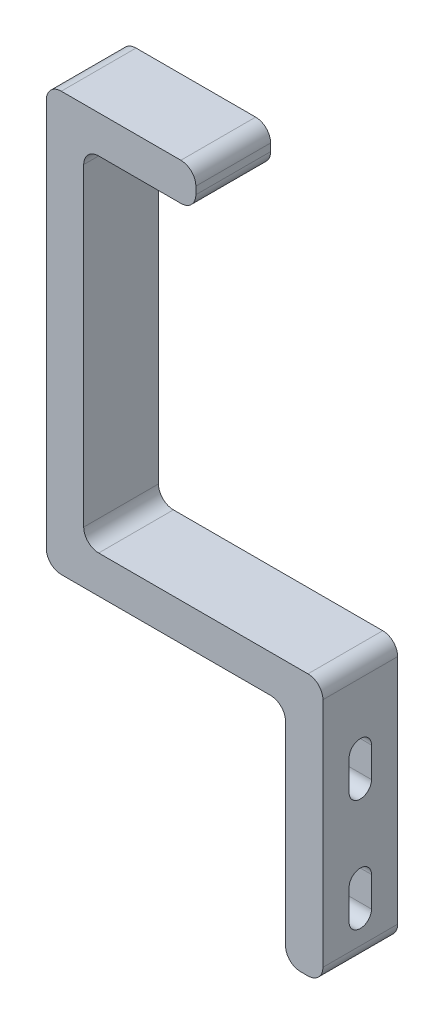
ISO-10303-21;
HEADER;
FILE_DESCRIPTION(('STEP AP214'),'2;1');
FILE_NAME('part.step','',(''),(''),'','','');
FILE_SCHEMA(('AUTOMOTIVE_DESIGN { 1 0 10303 214 1 1 1 1 }'));
ENDSEC;
DATA;
#1=APPLICATION_CONTEXT('core data for automotive mechanical design processes');
#2=APPLICATION_PROTOCOL_DEFINITION('international standard','automotive_design',2000,#1);
#3=PRODUCT_CONTEXT('',#1,'mechanical');
#4=PRODUCT('Part','Part','',(#3));
#5=PRODUCT_RELATED_PRODUCT_CATEGORY('part','',(#4));
#6=PRODUCT_DEFINITION_FORMATION('','',#4);
#7=PRODUCT_DEFINITION_CONTEXT('part definition',#1,'design');
#8=PRODUCT_DEFINITION('design','',#6,#7);
#9=PRODUCT_DEFINITION_SHAPE('','',#8);
#10=(LENGTH_UNIT() NAMED_UNIT(*) SI_UNIT(.MILLI.,.METRE.));
#11=(NAMED_UNIT(*) PLANE_ANGLE_UNIT() SI_UNIT($,.RADIAN.));
#12=(NAMED_UNIT(*) SI_UNIT($,.STERADIAN.) SOLID_ANGLE_UNIT());
#13=UNCERTAINTY_MEASURE_WITH_UNIT(LENGTH_MEASURE(1.E-05),#10,'distance_accuracy_value','');
#14=(GEOMETRIC_REPRESENTATION_CONTEXT(3) GLOBAL_UNCERTAINTY_ASSIGNED_CONTEXT((#13)) GLOBAL_UNIT_ASSIGNED_CONTEXT((#10,
#11,#12)) REPRESENTATION_CONTEXT('',''));
#15=CARTESIAN_POINT('',(0.,0.,0.));
#16=DIRECTION('',(0.,0.,1.));
#17=DIRECTION('',(1.,0.,0.));
#18=AXIS2_PLACEMENT_3D('',#15,#16,#17);
#19=CARTESIAN_POINT('',(0.,81.,10.));
#20=DIRECTION('',(0.,-1.,0.));
#21=DIRECTION('',(0.,0.,-1.));
#22=AXIS2_PLACEMENT_3D('',#19,#20,#21);
#23=PLANE('',#22);
#24=DIRECTION('',(-1.,0.,0.));
#25=VECTOR('',#24,1.);
#26=CARTESIAN_POINT('',(0.,81.,0.));
#27=LINE('',#26,#25);
#28=CARTESIAN_POINT('',(-16.5,81.,0.));
#29=VERTEX_POINT('',#28);
#30=CARTESIAN_POINT('',(-27.5,81.,0.));
#31=VERTEX_POINT('',#30);
#32=EDGE_CURVE('E303',#29,#31,#27,.T.);
#33=ORIENTED_EDGE('',*,*,#32,.F.);
#34=DIRECTION('',(0.,0.,-1.));
#35=VECTOR('',#34,1.);
#36=CARTESIAN_POINT('',(-16.5,81.,10.));
#37=LINE('',#36,#35);
#38=CARTESIAN_POINT('',(-16.5,81.,10.));
#39=VERTEX_POINT('',#38);
#40=EDGE_CURVE('E531',#29,#39,#37,.F.);
#41=ORIENTED_EDGE('',*,*,#40,.T.);
#42=DIRECTION('',(-1.,0.,0.));
#43=VECTOR('',#42,1.);
#44=CARTESIAN_POINT('',(0.,81.,10.));
#45=LINE('',#44,#43);
#46=CARTESIAN_POINT('',(-27.5,81.,10.));
#47=VERTEX_POINT('',#46);
#48=EDGE_CURVE('E338',#39,#47,#45,.T.);
#49=ORIENTED_EDGE('',*,*,#48,.T.);
#50=DIRECTION('',(0.,0.,-1.));
#51=VECTOR('',#50,1.);
#52=CARTESIAN_POINT('',(-27.5,81.,10.));
#53=LINE('',#52,#51);
#54=EDGE_CURVE('E527',#47,#31,#53,.T.);
#55=ORIENTED_EDGE('',*,*,#54,.T.);
#56=EDGE_LOOP('',(#33,#41,#49,#55));
#57=FACE_BOUND('',#56,.T.);
#58=ADVANCED_FACE('F43',(#57),#23,.T.);
#59=CARTESIAN_POINT('',(-14.5,0.,10.));
#60=DIRECTION('',(1.,0.,0.));
#61=DIRECTION('',(0.,1.,0.));
#62=AXIS2_PLACEMENT_3D('',#59,#60,#61);
#63=PLANE('',#62);
#64=DIRECTION('',(0.,-1.,0.));
#65=VECTOR('',#64,1.);
#66=CARTESIAN_POINT('',(-14.5,0.,10.));
#67=LINE('',#66,#65);
#68=CARTESIAN_POINT('',(-14.5,84.,10.));
#69=VERTEX_POINT('',#68);
#70=CARTESIAN_POINT('',(-14.5,83.,10.));
#71=VERTEX_POINT('',#70);
#72=EDGE_CURVE('E342',#69,#71,#67,.T.);
#73=ORIENTED_EDGE('',*,*,#72,.T.);
#74=DIRECTION('',(0.,0.,-1.));
#75=VECTOR('',#74,1.);
#76=CARTESIAN_POINT('',(-14.5,83.,10.));
#77=LINE('',#76,#75);
#78=CARTESIAN_POINT('',(-14.5,83.,0.));
#79=VERTEX_POINT('',#78);
#80=EDGE_CURVE('E502',#71,#79,#77,.T.);
#81=ORIENTED_EDGE('',*,*,#80,.T.);
#82=DIRECTION('',(0.,-1.,0.));
#83=VECTOR('',#82,1.);
#84=CARTESIAN_POINT('',(-14.5,0.,0.));
#85=LINE('',#84,#83);
#86=CARTESIAN_POINT('',(-14.5,84.,0.));
#87=VERTEX_POINT('',#86);
#88=EDGE_CURVE('E383',#87,#79,#85,.T.);
#89=ORIENTED_EDGE('',*,*,#88,.F.);
#90=DIRECTION('',(0.,0.,-1.));
#91=VECTOR('',#90,1.);
#92=CARTESIAN_POINT('',(-14.5,84.,10.));
#93=LINE('',#92,#91);
#94=EDGE_CURVE('E472',#87,#69,#93,.F.);
#95=ORIENTED_EDGE('',*,*,#94,.T.);
#96=EDGE_LOOP('',(#73,#81,#89,#95));
#97=FACE_BOUND('',#96,.T.);
#98=ADVANCED_FACE('F659',(#97),#63,.T.);
#99=CARTESIAN_POINT('',(0.,86.,10.));
#100=DIRECTION('',(0.,1.,0.));
#101=DIRECTION('',(-1.,0.,0.));
#102=AXIS2_PLACEMENT_3D('',#99,#100,#101);
#103=PLANE('',#102);
#104=DIRECTION('',(1.,0.,0.));
#105=VECTOR('',#104,1.);
#106=CARTESIAN_POINT('',(0.,86.,10.));
#107=LINE('',#106,#105);
#108=CARTESIAN_POINT('',(-32.5,86.,10.));
#109=VERTEX_POINT('',#108);
#110=CARTESIAN_POINT('',(-16.5,86.,10.));
#111=VERTEX_POINT('',#110);
#112=EDGE_CURVE('E347',#109,#111,#107,.T.);
#113=ORIENTED_EDGE('',*,*,#112,.T.);
#114=DIRECTION('',(0.,0.,-1.));
#115=VECTOR('',#114,1.);
#116=CARTESIAN_POINT('',(-16.5,86.,10.));
#117=LINE('',#116,#115);
#118=CARTESIAN_POINT('',(-16.5,86.,0.));
#119=VERTEX_POINT('',#118);
#120=EDGE_CURVE('E558',#111,#119,#117,.T.);
#121=ORIENTED_EDGE('',*,*,#120,.T.);
#122=DIRECTION('',(1.,0.,0.));
#123=VECTOR('',#122,1.);
#124=CARTESIAN_POINT('',(0.,86.,0.));
#125=LINE('',#124,#123);
#126=CARTESIAN_POINT('',(-32.5,86.,0.));
#127=VERTEX_POINT('',#126);
#128=EDGE_CURVE('E387',#127,#119,#125,.T.);
#129=ORIENTED_EDGE('',*,*,#128,.F.);
#130=DIRECTION('',(0.,0.,-1.));
#131=VECTOR('',#130,1.);
#132=CARTESIAN_POINT('',(-32.5,86.,10.));
#133=LINE('',#132,#131);
#134=EDGE_CURVE('E555',#127,#109,#133,.F.);
#135=ORIENTED_EDGE('',*,*,#134,.T.);
#136=EDGE_LOOP('',(#113,#121,#129,#135));
#137=FACE_BOUND('',#136,.T.);
#138=ADVANCED_FACE('F668',(#137),#103,.T.);
#139=CARTESIAN_POINT('',(-34.5,0.,10.));
#140=DIRECTION('',(-1.,0.,0.));
#141=DIRECTION('',(0.,0.,1.));
#142=AXIS2_PLACEMENT_3D('',#139,#140,#141);
#143=PLANE('',#142);
#144=DIRECTION('',(0.,1.,0.));
#145=VECTOR('',#144,1.);
#146=CARTESIAN_POINT('',(-34.5,0.,10.));
#147=LINE('',#146,#145);
#148=CARTESIAN_POINT('',(-34.5,32.,10.));
#149=VERTEX_POINT('',#148);
#150=CARTESIAN_POINT('',(-34.5,84.,10.));
#151=VERTEX_POINT('',#150);
#152=EDGE_CURVE('E351',#149,#151,#147,.T.);
#153=ORIENTED_EDGE('',*,*,#152,.T.);
#154=DIRECTION('',(0.,0.,-1.));
#155=VECTOR('',#154,1.);
#156=CARTESIAN_POINT('',(-34.5,84.,10.));
#157=LINE('',#156,#155);
#158=CARTESIAN_POINT('',(-34.5,84.,0.));
#159=VERTEX_POINT('',#158);
#160=EDGE_CURVE('E565',#151,#159,#157,.T.);
#161=ORIENTED_EDGE('',*,*,#160,.T.);
#162=DIRECTION('',(0.,1.,0.));
#163=VECTOR('',#162,1.);
#164=CARTESIAN_POINT('',(-34.5,0.,0.));
#165=LINE('',#164,#163);
#166=CARTESIAN_POINT('',(-34.5,32.,0.));
#167=VERTEX_POINT('',#166);
#168=EDGE_CURVE('E391',#167,#159,#165,.T.);
#169=ORIENTED_EDGE('',*,*,#168,.F.);
#170=DIRECTION('',(0.,0.,-1.));
#171=VECTOR('',#170,1.);
#172=CARTESIAN_POINT('',(-34.5,32.,10.));
#173=LINE('',#172,#171);
#174=EDGE_CURVE('E562',#167,#149,#173,.F.);
#175=ORIENTED_EDGE('',*,*,#174,.T.);
#176=EDGE_LOOP('',(#153,#161,#169,#175));
#177=FACE_BOUND('',#176,.T.);
#178=ADVANCED_FACE('F677',(#177),#143,.T.);
#179=CARTESIAN_POINT('',(0.,30.,10.));
#180=DIRECTION('',(0.,-1.,0.));
#181=DIRECTION('',(1.,0.,0.));
#182=AXIS2_PLACEMENT_3D('',#179,#180,#181);
#183=PLANE('',#182);
#184=DIRECTION('',(-1.,0.,0.));
#185=VECTOR('',#184,1.);
#186=CARTESIAN_POINT('',(0.,30.,10.));
#187=LINE('',#186,#185);
#188=CARTESIAN_POINT('',(-4.5,30.,10.));
#189=VERTEX_POINT('',#188);
#190=CARTESIAN_POINT('',(-32.5,30.,10.));
#191=VERTEX_POINT('',#190);
#192=EDGE_CURVE('E355',#189,#191,#187,.T.);
#193=ORIENTED_EDGE('',*,*,#192,.T.);
#194=DIRECTION('',(0.,0.,-1.));
#195=VECTOR('',#194,1.);
#196=CARTESIAN_POINT('',(-32.5,30.,10.));
#197=LINE('',#196,#195);
#198=CARTESIAN_POINT('',(-32.5,30.,0.));
#199=VERTEX_POINT('',#198);
#200=EDGE_CURVE('E572',#191,#199,#197,.T.);
#201=ORIENTED_EDGE('',*,*,#200,.T.);
#202=DIRECTION('',(-1.,0.,0.));
#203=VECTOR('',#202,1.);
#204=CARTESIAN_POINT('',(0.,30.,0.));
#205=LINE('',#204,#203);
#206=CARTESIAN_POINT('',(-4.5,30.,0.));
#207=VERTEX_POINT('',#206);
#208=EDGE_CURVE('E395',#207,#199,#205,.T.);
#209=ORIENTED_EDGE('',*,*,#208,.F.);
#210=DIRECTION('',(0.,0.,-1.));
#211=VECTOR('',#210,1.);
#212=CARTESIAN_POINT('',(-4.5,30.,10.));
#213=LINE('',#212,#211);
#214=EDGE_CURVE('E569',#207,#189,#213,.F.);
#215=ORIENTED_EDGE('',*,*,#214,.T.);
#216=EDGE_LOOP('',(#193,#201,#209,#215));
#217=FACE_BOUND('',#216,.T.);
#218=ADVANCED_FACE('F686',(#217),#183,.T.);
#219=CARTESIAN_POINT('',(-2.5,0.,10.));
#220=DIRECTION('',(-1.,0.,0.));
#221=DIRECTION('',(0.,0.,1.));
#222=AXIS2_PLACEMENT_3D('',#219,#220,#221);
#223=PLANE('',#222);
#224=DIRECTION('',(0.,1.,0.));
#225=VECTOR('',#224,1.);
#226=CARTESIAN_POINT('',(-2.5,0.,10.));
#227=LINE('',#226,#225);
#228=CARTESIAN_POINT('',(-2.5,2.,10.));
#229=VERTEX_POINT('',#228);
#230=CARTESIAN_POINT('',(-2.5,28.,10.));
#231=VERTEX_POINT('',#230);
#232=EDGE_CURVE('E359',#229,#231,#227,.T.);
#233=ORIENTED_EDGE('',*,*,#232,.T.);
#234=DIRECTION('',(0.,0.,-1.));
#235=VECTOR('',#234,1.);
#236=CARTESIAN_POINT('',(-2.5,28.,0.));
#237=LINE('',#236,#235);
#238=CARTESIAN_POINT('',(-2.5,28.,5.));
#239=VERTEX_POINT('',#238);
#240=EDGE_CURVE('E583',#231,#239,#237,.T.);
#241=ORIENTED_EDGE('',*,*,#240,.T.);
#242=CARTESIAN_POINT('',(-2.5,24.5,5.));
#243=DIRECTION('',(-1.,0.,0.));
#244=DIRECTION('',(0.,0.,1.));
#245=AXIS2_PLACEMENT_3D('',#242,#243,#244);
#246=CIRCLE('',#245,3.50000000000001);
#247=CARTESIAN_POINT('',(-2.5,24.5,8.50000000000002));
#248=VERTEX_POINT('',#247);
#249=EDGE_CURVE('E427',#239,#248,#246,.F.);
#250=ORIENTED_EDGE('',*,*,#249,.T.);
#251=DIRECTION('',(0.,-1.,0.));
#252=VECTOR('',#251,1.);
#253=CARTESIAN_POINT('',(-2.5,20.5,8.50000000000001));
#254=LINE('',#253,#252);
#255=CARTESIAN_POINT('',(-2.5,20.5,8.50000000000001));
#256=VERTEX_POINT('',#255);
#257=EDGE_CURVE('E432',#248,#256,#254,.T.);
#258=ORIENTED_EDGE('',*,*,#257,.T.);
#259=CARTESIAN_POINT('',(-2.5,20.5,5.));
#260=DIRECTION('',(-1.,0.,0.));
#261=DIRECTION('',(0.,0.,1.));
#262=AXIS2_PLACEMENT_3D('',#259,#260,#261);
#263=CIRCLE('',#262,3.50000000000001);
#264=CARTESIAN_POINT('',(-2.5,20.5,1.49999999999998));
#265=VERTEX_POINT('',#264);
#266=EDGE_CURVE('E424',#256,#265,#263,.F.);
#267=ORIENTED_EDGE('',*,*,#266,.T.);
#268=DIRECTION('',(0.,1.,0.));
#269=VECTOR('',#268,1.);
#270=CARTESIAN_POINT('',(-2.5,24.5,1.49999999999998));
#271=LINE('',#270,#269);
#272=CARTESIAN_POINT('',(-2.5,24.5,1.49999999999998));
#273=VERTEX_POINT('',#272);
#274=EDGE_CURVE('E421',#265,#273,#271,.T.);
#275=ORIENTED_EDGE('',*,*,#274,.T.);
#276=EDGE_CURVE('E428',#273,#239,#246,.F.);
#277=ORIENTED_EDGE('',*,*,#276,.T.);
#278=DIRECTION('',(0.,0.,-1.));
#279=VECTOR('',#278,1.);
#280=CARTESIAN_POINT('',(-2.5,28.,0.));
#281=LINE('',#280,#279);
#282=CARTESIAN_POINT('',(-2.5,28.,0.));
#283=VERTEX_POINT('',#282);
#284=EDGE_CURVE('E59',#239,#283,#281,.T.);
#285=ORIENTED_EDGE('',*,*,#284,.T.);
#286=DIRECTION('',(0.,1.,0.));
#287=VECTOR('',#286,1.);
#288=CARTESIAN_POINT('',(-2.5,0.,0.));
#289=LINE('',#288,#287);
#290=CARTESIAN_POINT('',(-2.5,2.,0.));
#291=VERTEX_POINT('',#290);
#292=EDGE_CURVE('E399',#291,#283,#289,.T.);
#293=ORIENTED_EDGE('',*,*,#292,.F.);
#294=DIRECTION('',(0.,0.,-1.));
#295=VECTOR('',#294,1.);
#296=CARTESIAN_POINT('',(-2.5,2.,10.));
#297=LINE('',#296,#295);
#298=CARTESIAN_POINT('',(-2.5,2.,5.));
#299=VERTEX_POINT('',#298);
#300=EDGE_CURVE('E67',#291,#299,#297,.F.);
#301=ORIENTED_EDGE('',*,*,#300,.T.);
#302=CARTESIAN_POINT('',(-2.5,5.49999999999999,5.));
#303=DIRECTION('',(-1.,0.,0.));
#304=DIRECTION('',(0.,0.,1.));
#305=AXIS2_PLACEMENT_3D('',#302,#303,#304);
#306=CIRCLE('',#305,3.50000000000001);
#307=CARTESIAN_POINT('',(-2.5,5.49999999999999,1.49999999999999));
#308=VERTEX_POINT('',#307);
#309=EDGE_CURVE('E439',#299,#308,#306,.F.);
#310=ORIENTED_EDGE('',*,*,#309,.T.);
#311=DIRECTION('',(0.,1.,0.));
#312=VECTOR('',#311,1.);
#313=CARTESIAN_POINT('',(-2.5,9.49999999999999,1.49999999999998));
#314=LINE('',#313,#312);
#315=CARTESIAN_POINT('',(-2.5,9.49999999999998,1.49999999999998));
#316=VERTEX_POINT('',#315);
#317=EDGE_CURVE('E436',#308,#316,#314,.T.);
#318=ORIENTED_EDGE('',*,*,#317,.T.);
#319=CARTESIAN_POINT('',(-2.5,9.49999999999999,5.));
#320=DIRECTION('',(-1.,0.,0.));
#321=DIRECTION('',(0.,0.,1.));
#322=AXIS2_PLACEMENT_3D('',#319,#320,#321);
#323=CIRCLE('',#322,3.50000000000002);
#324=CARTESIAN_POINT('',(-2.5,9.49999999999999,8.50000000000002));
#325=VERTEX_POINT('',#324);
#326=EDGE_CURVE('E444',#316,#325,#323,.F.);
#327=ORIENTED_EDGE('',*,*,#326,.T.);
#328=DIRECTION('',(0.,-1.,0.));
#329=VECTOR('',#328,1.);
#330=CARTESIAN_POINT('',(-2.5,5.49999999999999,8.50000000000001));
#331=LINE('',#330,#329);
#332=CARTESIAN_POINT('',(-2.5,5.49999999999999,8.50000000000002));
#333=VERTEX_POINT('',#332);
#334=EDGE_CURVE('E447',#325,#333,#331,.T.);
#335=ORIENTED_EDGE('',*,*,#334,.T.);
#336=EDGE_CURVE('E440',#333,#299,#306,.F.);
#337=ORIENTED_EDGE('',*,*,#336,.T.);
#338=DIRECTION('',(0.,0.,-1.));
#339=VECTOR('',#338,1.);
#340=CARTESIAN_POINT('',(-2.5,2.,10.));
#341=LINE('',#340,#339);
#342=EDGE_CURVE('E576',#299,#229,#341,.F.);
#343=ORIENTED_EDGE('',*,*,#342,.T.);
#344=EDGE_LOOP('',(#233,#241,#250,#258,#267,#275,#277,#285,#293,#301,#310,#318,#327,#335,#337,#343));
#345=FACE_BOUND('',#344,.T.);
#346=ADVANCED_FACE('F692',(#345),#223,.T.);
#347=CARTESIAN_POINT('',(0.,0.,10.));
#348=DIRECTION('',(0.,1.,0.));
#349=DIRECTION('',(0.,0.,1.));
#350=AXIS2_PLACEMENT_3D('',#347,#348,#349);
#351=PLANE('',#350);
#352=DIRECTION('',(1.,0.,0.));
#353=VECTOR('',#352,1.);
#354=CARTESIAN_POINT('',(0.,0.,10.));
#355=LINE('',#354,#353);
#356=CARTESIAN_POINT('',(-0.5,0.,10.));
#357=VERTEX_POINT('',#356);
#358=CARTESIAN_POINT('',(0.5,0.,10.));
#359=VERTEX_POINT('',#358);
#360=EDGE_CURVE('E363',#357,#359,#355,.T.);
#361=ORIENTED_EDGE('',*,*,#360,.F.);
#362=DIRECTION('',(0.,0.,-1.));
#363=VECTOR('',#362,1.);
#364=CARTESIAN_POINT('',(-0.5,0.,0.));
#365=LINE('',#364,#363);
#366=CARTESIAN_POINT('',(-0.5,0.,0.));
#367=VERTEX_POINT('',#366);
#368=EDGE_CURVE('E589',#357,#367,#365,.T.);
#369=ORIENTED_EDGE('',*,*,#368,.T.);
#370=DIRECTION('',(1.,0.,0.));
#371=VECTOR('',#370,1.);
#372=CARTESIAN_POINT('',(0.,0.,0.));
#373=LINE('',#372,#371);
#374=CARTESIAN_POINT('',(0.5,0.,0.));
#375=VERTEX_POINT('',#374);
#376=EDGE_CURVE('E403',#367,#375,#373,.T.);
#377=ORIENTED_EDGE('',*,*,#376,.T.);
#378=DIRECTION('',(0.,0.,-1.));
#379=VECTOR('',#378,1.);
#380=CARTESIAN_POINT('',(0.5,0.,10.));
#381=LINE('',#380,#379);
#382=EDGE_CURVE('E586',#375,#359,#381,.F.);
#383=ORIENTED_EDGE('',*,*,#382,.T.);
#384=EDGE_LOOP('',(#361,#369,#377,#383));
#385=FACE_BOUND('',#384,.T.);
#386=ADVANCED_FACE('F702',(#385),#351,.F.);
#387=CARTESIAN_POINT('',(2.5,0.,10.));
#388=DIRECTION('',(-1.,0.,0.));
#389=DIRECTION('',(0.,0.,1.));
#390=AXIS2_PLACEMENT_3D('',#387,#388,#389);
#391=PLANE('',#390);
#392=DIRECTION('',(0.,1.,0.));
#393=VECTOR('',#392,1.);
#394=CARTESIAN_POINT('',(2.5,24.5,6.5));
#395=LINE('',#394,#393);
#396=CARTESIAN_POINT('',(2.5,20.5,6.5));
#397=VERTEX_POINT('',#396);
#398=CARTESIAN_POINT('',(2.5,24.5,6.5));
#399=VERTEX_POINT('',#398);
#400=EDGE_CURVE('E273',#397,#399,#395,.T.);
#401=ORIENTED_EDGE('',*,*,#400,.T.);
#402=CARTESIAN_POINT('',(2.5,24.5,5.));
#403=DIRECTION('',(-1.,0.,0.));
#404=DIRECTION('',(0.,0.,1.));
#405=AXIS2_PLACEMENT_3D('',#402,#403,#404);
#406=CIRCLE('',#405,1.5);
#407=CARTESIAN_POINT('',(2.5,24.5,3.5));
#408=VERTEX_POINT('',#407);
#409=EDGE_CURVE('E265',#399,#408,#406,.T.);
#410=ORIENTED_EDGE('',*,*,#409,.T.);
#411=DIRECTION('',(0.,-1.,0.));
#412=VECTOR('',#411,1.);
#413=CARTESIAN_POINT('',(2.5,24.5,3.5));
#414=LINE('',#413,#412);
#415=CARTESIAN_POINT('',(2.5,20.5,3.5));
#416=VERTEX_POINT('',#415);
#417=EDGE_CURVE('E277',#408,#416,#414,.T.);
#418=ORIENTED_EDGE('',*,*,#417,.T.);
#419=CARTESIAN_POINT('',(2.5,20.5,5.));
#420=DIRECTION('',(-1.,0.,0.));
#421=DIRECTION('',(0.,0.,1.));
#422=AXIS2_PLACEMENT_3D('',#419,#420,#421);
#423=CIRCLE('',#422,1.5);
#424=EDGE_CURVE('E283',#416,#397,#423,.T.);
#425=ORIENTED_EDGE('',*,*,#424,.T.);
#426=EDGE_LOOP('',(#401,#410,#418,#425));
#427=FACE_BOUND('',#426,.T.);
#428=DIRECTION('',(0.,-1.,0.));
#429=VECTOR('',#428,1.);
#430=CARTESIAN_POINT('',(2.5,5.49999999999999,3.5));
#431=LINE('',#430,#429);
#432=CARTESIAN_POINT('',(2.5,9.49999999999999,3.5));
#433=VERTEX_POINT('',#432);
#434=CARTESIAN_POINT('',(2.5,5.49999999999999,3.5));
#435=VERTEX_POINT('',#434);
#436=EDGE_CURVE('E323',#433,#435,#431,.T.);
#437=ORIENTED_EDGE('',*,*,#436,.T.);
#438=CARTESIAN_POINT('',(2.5,5.49999999999999,5.));
#439=DIRECTION('',(-1.,0.,0.));
#440=DIRECTION('',(0.,0.,-1.));
#441=AXIS2_PLACEMENT_3D('',#438,#439,#440);
#442=CIRCLE('',#441,1.5);
#443=CARTESIAN_POINT('',(2.5,5.49999999999999,6.5));
#444=VERTEX_POINT('',#443);
#445=EDGE_CURVE('E310',#435,#444,#442,.T.);
#446=ORIENTED_EDGE('',*,*,#445,.T.);
#447=DIRECTION('',(0.,1.,0.));
#448=VECTOR('',#447,1.);
#449=CARTESIAN_POINT('',(2.5,5.49999999999999,6.5));
#450=LINE('',#449,#448);
#451=CARTESIAN_POINT('',(2.5,9.49999999999999,6.5));
#452=VERTEX_POINT('',#451);
#453=EDGE_CURVE('E314',#444,#452,#450,.T.);
#454=ORIENTED_EDGE('',*,*,#453,.T.);
#455=CARTESIAN_POINT('',(2.5,9.49999999999999,5.));
#456=DIRECTION('',(-1.,0.,0.));
#457=DIRECTION('',(0.,0.,-1.));
#458=AXIS2_PLACEMENT_3D('',#455,#456,#457);
#459=CIRCLE('',#458,1.5);
#460=EDGE_CURVE('E319',#452,#433,#459,.T.);
#461=ORIENTED_EDGE('',*,*,#460,.T.);
#462=EDGE_LOOP('',(#437,#446,#454,#461));
#463=FACE_BOUND('',#462,.T.);
#464=DIRECTION('',(0.,1.,0.));
#465=VECTOR('',#464,1.);
#466=CARTESIAN_POINT('',(2.5,0.,10.));
#467=LINE('',#466,#465);
#468=CARTESIAN_POINT('',(2.5,2.,10.));
#469=VERTEX_POINT('',#468);
#470=CARTESIAN_POINT('',(2.5,33.,10.));
#471=VERTEX_POINT('',#470);
#472=EDGE_CURVE('E367',#469,#471,#467,.T.);
#473=ORIENTED_EDGE('',*,*,#472,.F.);
#474=DIRECTION('',(0.,0.,-1.));
#475=VECTOR('',#474,1.);
#476=CARTESIAN_POINT('',(2.5,2.,10.));
#477=LINE('',#476,#475);
#478=CARTESIAN_POINT('',(2.5,2.,0.));
#479=VERTEX_POINT('',#478);
#480=EDGE_CURVE('E596',#469,#479,#477,.T.);
#481=ORIENTED_EDGE('',*,*,#480,.T.);
#482=DIRECTION('',(0.,1.,0.));
#483=VECTOR('',#482,1.);
#484=CARTESIAN_POINT('',(2.5,0.,0.));
#485=LINE('',#484,#483);
#486=CARTESIAN_POINT('',(2.5,33.,0.));
#487=VERTEX_POINT('',#486);
#488=EDGE_CURVE('E407',#479,#487,#485,.T.);
#489=ORIENTED_EDGE('',*,*,#488,.T.);
#490=DIRECTION('',(0.,0.,-1.));
#491=VECTOR('',#490,1.);
#492=CARTESIAN_POINT('',(2.5,33.,10.));
#493=LINE('',#492,#491);
#494=EDGE_CURVE('E593',#487,#471,#493,.F.);
#495=ORIENTED_EDGE('',*,*,#494,.T.);
#496=EDGE_LOOP('',(#473,#481,#489,#495));
#497=FACE_BOUND('',#496,.T.);
#498=ADVANCED_FACE('F285',(#427,#463,#497),#391,.F.);
#499=CARTESIAN_POINT('',(0.,35.,10.));
#500=DIRECTION('',(0.,-1.,0.));
#501=DIRECTION('',(1.,0.,0.));
#502=AXIS2_PLACEMENT_3D('',#499,#500,#501);
#503=PLANE('',#502);
#504=DIRECTION('',(-1.,0.,0.));
#505=VECTOR('',#504,1.);
#506=CARTESIAN_POINT('',(0.,35.,10.));
#507=LINE('',#506,#505);
#508=CARTESIAN_POINT('',(0.5,35.,10.));
#509=VERTEX_POINT('',#508);
#510=CARTESIAN_POINT('',(-27.5,35.,10.));
#511=VERTEX_POINT('',#510);
#512=EDGE_CURVE('E371',#509,#511,#507,.T.);
#513=ORIENTED_EDGE('',*,*,#512,.F.);
#514=DIRECTION('',(0.,0.,-1.));
#515=VECTOR('',#514,1.);
#516=CARTESIAN_POINT('',(0.5,35.,10.));
#517=LINE('',#516,#515);
#518=CARTESIAN_POINT('',(0.5,35.,0.));
#519=VERTEX_POINT('',#518);
#520=EDGE_CURVE('E603',#509,#519,#517,.T.);
#521=ORIENTED_EDGE('',*,*,#520,.T.);
#522=DIRECTION('',(-1.,0.,0.));
#523=VECTOR('',#522,1.);
#524=CARTESIAN_POINT('',(0.,35.,0.));
#525=LINE('',#524,#523);
#526=CARTESIAN_POINT('',(-27.5,35.,0.));
#527=VERTEX_POINT('',#526);
#528=EDGE_CURVE('E411',#519,#527,#525,.T.);
#529=ORIENTED_EDGE('',*,*,#528,.T.);
#530=DIRECTION('',(0.,0.,-1.));
#531=VECTOR('',#530,1.);
#532=CARTESIAN_POINT('',(-27.5,35.,10.));
#533=LINE('',#532,#531);
#534=EDGE_CURVE('E600',#527,#511,#533,.F.);
#535=ORIENTED_EDGE('',*,*,#534,.T.);
#536=EDGE_LOOP('',(#513,#521,#529,#535));
#537=FACE_BOUND('',#536,.T.);
#538=ADVANCED_FACE('F635',(#537),#503,.F.);
#539=CARTESIAN_POINT('',(-29.5,0.,10.));
#540=DIRECTION('',(-1.,0.,0.));
#541=DIRECTION('',(0.,0.,1.));
#542=AXIS2_PLACEMENT_3D('',#539,#540,#541);
#543=PLANE('',#542);
#544=DIRECTION('',(0.,1.,0.));
#545=VECTOR('',#544,1.);
#546=CARTESIAN_POINT('',(-29.5,0.,0.));
#547=LINE('',#546,#545);
#548=CARTESIAN_POINT('',(-29.5,37.,0.));
#549=VERTEX_POINT('',#548);
#550=CARTESIAN_POINT('',(-29.5,79.,0.));
#551=VERTEX_POINT('',#550);
#552=EDGE_CURVE('E343',#549,#551,#547,.T.);
#553=ORIENTED_EDGE('',*,*,#552,.T.);
#554=DIRECTION('',(0.,0.,-1.));
#555=VECTOR('',#554,1.);
#556=CARTESIAN_POINT('',(-29.5,79.,10.));
#557=LINE('',#556,#555);
#558=CARTESIAN_POINT('',(-29.5,79.,10.));
#559=VERTEX_POINT('',#558);
#560=EDGE_CURVE('E611',#551,#559,#557,.F.);
#561=ORIENTED_EDGE('',*,*,#560,.T.);
#562=DIRECTION('',(0.,1.,0.));
#563=VECTOR('',#562,1.);
#564=CARTESIAN_POINT('',(-29.5,0.,10.));
#565=LINE('',#564,#563);
#566=CARTESIAN_POINT('',(-29.5,37.,10.));
#567=VERTEX_POINT('',#566);
#568=EDGE_CURVE('E375',#567,#559,#565,.T.);
#569=ORIENTED_EDGE('',*,*,#568,.F.);
#570=DIRECTION('',(0.,0.,-1.));
#571=VECTOR('',#570,1.);
#572=CARTESIAN_POINT('',(-29.5,37.,0.));
#573=LINE('',#572,#571);
#574=EDGE_CURVE('E607',#567,#549,#573,.T.);
#575=ORIENTED_EDGE('',*,*,#574,.T.);
#576=EDGE_LOOP('',(#553,#561,#569,#575));
#577=FACE_BOUND('',#576,.T.);
#578=ADVANCED_FACE('F644',(#577),#543,.F.);
#579=CARTESIAN_POINT('',(0.,0.,10.));
#580=DIRECTION('',(0.,0.,1.));
#581=DIRECTION('',(1.,0.,0.));
#582=AXIS2_PLACEMENT_3D('',#579,#580,#581);
#583=PLANE('',#582);
#584=ORIENTED_EDGE('',*,*,#48,.F.);
#585=CARTESIAN_POINT('',(-16.5,83.,10.));
#586=DIRECTION('',(0.,0.,1.));
#587=DIRECTION('',(1.,0.,0.));
#588=AXIS2_PLACEMENT_3D('',#585,#586,#587);
#589=CIRCLE('',#588,2.);
#590=EDGE_CURVE('E552',#39,#71,#589,.T.);
#591=ORIENTED_EDGE('',*,*,#590,.T.);
#592=ORIENTED_EDGE('',*,*,#72,.F.);
#593=CARTESIAN_POINT('',(-16.5,84.,10.));
#594=DIRECTION('',(0.,0.,1.));
#595=DIRECTION('',(1.,0.,0.));
#596=AXIS2_PLACEMENT_3D('',#593,#594,#595);
#597=CIRCLE('',#596,2.);
#598=EDGE_CURVE('E549',#69,#111,#597,.T.);
#599=ORIENTED_EDGE('',*,*,#598,.T.);
#600=ORIENTED_EDGE('',*,*,#112,.F.);
#601=CARTESIAN_POINT('',(-32.5,84.,10.));
#602=DIRECTION('',(0.,0.,1.));
#603=DIRECTION('',(1.,0.,0.));
#604=AXIS2_PLACEMENT_3D('',#601,#602,#603);
#605=CIRCLE('',#604,2.);
#606=EDGE_CURVE('E546',#109,#151,#605,.T.);
#607=ORIENTED_EDGE('',*,*,#606,.T.);
#608=ORIENTED_EDGE('',*,*,#152,.F.);
#609=CARTESIAN_POINT('',(-32.5,32.,10.));
#610=DIRECTION('',(0.,0.,1.));
#611=DIRECTION('',(1.,0.,0.));
#612=AXIS2_PLACEMENT_3D('',#609,#610,#611);
#613=CIRCLE('',#612,2.);
#614=EDGE_CURVE('E543',#149,#191,#613,.T.);
#615=ORIENTED_EDGE('',*,*,#614,.T.);
#616=ORIENTED_EDGE('',*,*,#192,.F.);
#617=CARTESIAN_POINT('',(-4.5,28.,10.));
#618=DIRECTION('',(0.,0.,1.));
#619=DIRECTION('',(1.,0.,0.));
#620=AXIS2_PLACEMENT_3D('',#617,#618,#619);
#621=CIRCLE('',#620,2.);
#622=EDGE_CURVE('E617',#189,#231,#621,.F.);
#623=ORIENTED_EDGE('',*,*,#622,.T.);
#624=ORIENTED_EDGE('',*,*,#232,.F.);
#625=CARTESIAN_POINT('',(-0.5,2.,10.));
#626=DIRECTION('',(0.,0.,1.));
#627=DIRECTION('',(1.,0.,0.));
#628=AXIS2_PLACEMENT_3D('',#625,#626,#627);
#629=CIRCLE('',#628,2.);
#630=EDGE_CURVE('E540',#229,#357,#629,.T.);
#631=ORIENTED_EDGE('',*,*,#630,.T.);
#632=ORIENTED_EDGE('',*,*,#360,.T.);
#633=CARTESIAN_POINT('',(0.5,2.,10.));
#634=DIRECTION('',(0.,0.,1.));
#635=DIRECTION('',(1.,0.,0.));
#636=AXIS2_PLACEMENT_3D('',#633,#634,#635);
#637=CIRCLE('',#636,2.);
#638=EDGE_CURVE('E537',#359,#469,#637,.T.);
#639=ORIENTED_EDGE('',*,*,#638,.T.);
#640=ORIENTED_EDGE('',*,*,#472,.T.);
#641=CARTESIAN_POINT('',(0.5,33.,10.));
#642=DIRECTION('',(0.,0.,1.));
#643=DIRECTION('',(1.,0.,0.));
#644=AXIS2_PLACEMENT_3D('',#641,#642,#643);
#645=CIRCLE('',#644,2.);
#646=EDGE_CURVE('E534',#471,#509,#645,.T.);
#647=ORIENTED_EDGE('',*,*,#646,.T.);
#648=ORIENTED_EDGE('',*,*,#512,.T.);
#649=CARTESIAN_POINT('',(-27.5,37.,10.));
#650=DIRECTION('',(0.,0.,1.));
#651=DIRECTION('',(1.,0.,0.));
#652=AXIS2_PLACEMENT_3D('',#649,#650,#651);
#653=CIRCLE('',#652,2.);
#654=EDGE_CURVE('E11',#511,#567,#653,.F.);
#655=ORIENTED_EDGE('',*,*,#654,.T.);
#656=ORIENTED_EDGE('',*,*,#568,.T.);
#657=CARTESIAN_POINT('',(-27.5,79.,10.));
#658=DIRECTION('',(0.,0.,1.));
#659=DIRECTION('',(1.,0.,0.));
#660=AXIS2_PLACEMENT_3D('',#657,#658,#659);
#661=CIRCLE('',#660,2.);
#662=EDGE_CURVE('E623',#559,#47,#661,.F.);
#663=ORIENTED_EDGE('',*,*,#662,.T.);
#664=EDGE_LOOP('',(#584,#591,#592,#599,#600,#607,#608,#615,#616,#623,#624,#631,#632,#639,#640,
#647,#648,#655,#656,#663));
#665=FACE_BOUND('',#664,.T.);
#666=ADVANCED_FACE('F641',(#665),#583,.T.);
#667=CARTESIAN_POINT('',(0.,0.,0.));
#668=DIRECTION('',(0.,0.,1.));
#669=DIRECTION('',(1.,0.,0.));
#670=AXIS2_PLACEMENT_3D('',#667,#668,#669);
#671=PLANE('',#670);
#672=ORIENTED_EDGE('',*,*,#88,.T.);
#673=CARTESIAN_POINT('',(-16.5,83.,0.));
#674=DIRECTION('',(0.,0.,1.));
#675=DIRECTION('',(1.,0.,0.));
#676=AXIS2_PLACEMENT_3D('',#673,#674,#675);
#677=CIRCLE('',#676,2.);
#678=EDGE_CURVE('E524',#79,#29,#677,.F.);
#679=ORIENTED_EDGE('',*,*,#678,.T.);
#680=ORIENTED_EDGE('',*,*,#32,.T.);
#681=CARTESIAN_POINT('',(-27.5,79.,0.));
#682=DIRECTION('',(0.,0.,1.));
#683=DIRECTION('',(1.,0.,0.));
#684=AXIS2_PLACEMENT_3D('',#681,#682,#683);
#685=CIRCLE('',#684,2.);
#686=EDGE_CURVE('E620',#31,#551,#685,.T.);
#687=ORIENTED_EDGE('',*,*,#686,.T.);
#688=ORIENTED_EDGE('',*,*,#552,.F.);
#689=CARTESIAN_POINT('',(-27.5,37.,0.));
#690=DIRECTION('',(0.,0.,1.));
#691=DIRECTION('',(1.,0.,0.));
#692=AXIS2_PLACEMENT_3D('',#689,#690,#691);
#693=CIRCLE('',#692,2.);
#694=EDGE_CURVE('E52',#549,#527,#693,.T.);
#695=ORIENTED_EDGE('',*,*,#694,.T.);
#696=ORIENTED_EDGE('',*,*,#528,.F.);
#697=CARTESIAN_POINT('',(0.5,33.,0.));
#698=DIRECTION('',(0.,0.,1.));
#699=DIRECTION('',(1.,0.,0.));
#700=AXIS2_PLACEMENT_3D('',#697,#698,#699);
#701=CIRCLE('',#700,2.);
#702=EDGE_CURVE('E506',#519,#487,#701,.F.);
#703=ORIENTED_EDGE('',*,*,#702,.T.);
#704=ORIENTED_EDGE('',*,*,#488,.F.);
#705=CARTESIAN_POINT('',(0.5,2.,0.));
#706=DIRECTION('',(0.,0.,1.));
#707=DIRECTION('',(1.,0.,0.));
#708=AXIS2_PLACEMENT_3D('',#705,#706,#707);
#709=CIRCLE('',#708,2.);
#710=EDGE_CURVE('E509',#479,#375,#709,.F.);
#711=ORIENTED_EDGE('',*,*,#710,.T.);
#712=ORIENTED_EDGE('',*,*,#376,.F.);
#713=CARTESIAN_POINT('',(-0.5,2.,0.));
#714=DIRECTION('',(0.,0.,1.));
#715=DIRECTION('',(1.,0.,0.));
#716=AXIS2_PLACEMENT_3D('',#713,#714,#715);
#717=CIRCLE('',#716,2.);
#718=EDGE_CURVE('E512',#367,#291,#717,.F.);
#719=ORIENTED_EDGE('',*,*,#718,.T.);
#720=ORIENTED_EDGE('',*,*,#292,.T.);
#721=CARTESIAN_POINT('',(-4.5,28.,0.));
#722=DIRECTION('',(0.,0.,1.));
#723=DIRECTION('',(1.,0.,0.));
#724=AXIS2_PLACEMENT_3D('',#721,#722,#723);
#725=CIRCLE('',#724,2.);
#726=EDGE_CURVE('E614',#283,#207,#725,.T.);
#727=ORIENTED_EDGE('',*,*,#726,.T.);
#728=ORIENTED_EDGE('',*,*,#208,.T.);
#729=CARTESIAN_POINT('',(-32.5,32.,0.));
#730=DIRECTION('',(0.,0.,1.));
#731=DIRECTION('',(1.,0.,0.));
#732=AXIS2_PLACEMENT_3D('',#729,#730,#731);
#733=CIRCLE('',#732,2.);
#734=EDGE_CURVE('E515',#199,#167,#733,.F.);
#735=ORIENTED_EDGE('',*,*,#734,.T.);
#736=ORIENTED_EDGE('',*,*,#168,.T.);
#737=CARTESIAN_POINT('',(-32.5,84.,0.));
#738=DIRECTION('',(0.,0.,1.));
#739=DIRECTION('',(1.,0.,0.));
#740=AXIS2_PLACEMENT_3D('',#737,#738,#739);
#741=CIRCLE('',#740,2.);
#742=EDGE_CURVE('E518',#159,#127,#741,.F.);
#743=ORIENTED_EDGE('',*,*,#742,.T.);
#744=ORIENTED_EDGE('',*,*,#128,.T.);
#745=CARTESIAN_POINT('',(-16.5,84.,0.));
#746=DIRECTION('',(0.,0.,1.));
#747=DIRECTION('',(1.,0.,0.));
#748=AXIS2_PLACEMENT_3D('',#745,#746,#747);
#749=CIRCLE('',#748,2.);
#750=EDGE_CURVE('E521',#119,#87,#749,.F.);
#751=ORIENTED_EDGE('',*,*,#750,.T.);
#752=EDGE_LOOP('',(#672,#679,#680,#687,#688,#695,#696,#703,#704,#711,#712,#719,#720,#727,#728,
#735,#736,#743,#744,#751));
#753=FACE_BOUND('',#752,.T.);
#754=ADVANCED_FACE('F629',(#753),#671,.F.);
#755=CARTESIAN_POINT('',(2.5,5.49999999999999,5.));
#756=DIRECTION('',(-1.,0.,0.));
#757=DIRECTION('',(0.,0.,1.));
#758=AXIS2_PLACEMENT_3D('',#755,#756,#757);
#759=CYLINDRICAL_SURFACE('',#758,1.5);
#760=DIRECTION('',(-1.,0.,0.));
#761=VECTOR('',#760,1.);
#762=CARTESIAN_POINT('',(2.5,5.49999999999999,3.5));
#763=LINE('',#762,#761);
#764=CARTESIAN_POINT('',(-1.34529946162075,5.49999999999999,3.5));
#765=VERTEX_POINT('',#764);
#766=EDGE_CURVE('E289',#435,#765,#763,.T.);
#767=ORIENTED_EDGE('',*,*,#766,.T.);
#768=CARTESIAN_POINT('',(-1.34529946162075,5.49999999999999,5.));
#769=DIRECTION('',(-1.,0.,0.));
#770=DIRECTION('',(0.,0.,1.));
#771=AXIS2_PLACEMENT_3D('',#768,#769,#770);
#772=CIRCLE('',#771,1.5);
#773=CARTESIAN_POINT('',(-1.34529946162075,5.49999999999999,6.5));
#774=VERTEX_POINT('',#773);
#775=EDGE_CURVE('E454',#765,#774,#772,.T.);
#776=ORIENTED_EDGE('',*,*,#775,.T.);
#777=DIRECTION('',(-1.,0.,0.));
#778=VECTOR('',#777,1.);
#779=CARTESIAN_POINT('',(2.5,5.49999999999999,6.5));
#780=LINE('',#779,#778);
#781=EDGE_CURVE('E326',#444,#774,#780,.T.);
#782=ORIENTED_EDGE('',*,*,#781,.F.);
#783=ORIENTED_EDGE('',*,*,#445,.F.);
#784=EDGE_LOOP('',(#767,#776,#782,#783));
#785=FACE_BOUND('',#784,.T.);
#786=ADVANCED_FACE('F737',(#785),#759,.F.);
#787=CARTESIAN_POINT('',(2.5,5.49999999999999,3.5));
#788=DIRECTION('',(0.,0.,-1.));
#789=DIRECTION('',(0.,1.,0.));
#790=AXIS2_PLACEMENT_3D('',#787,#788,#789);
#791=PLANE('',#790);
#792=DIRECTION('',(-1.,0.,0.));
#793=VECTOR('',#792,1.);
#794=CARTESIAN_POINT('',(2.5,9.49999999999999,3.5));
#795=LINE('',#794,#793);
#796=CARTESIAN_POINT('',(-1.34529946162075,9.49999999999999,3.5));
#797=VERTEX_POINT('',#796);
#798=EDGE_CURVE('E293',#433,#797,#795,.T.);
#799=ORIENTED_EDGE('',*,*,#798,.T.);
#800=DIRECTION('',(0.,-1.,0.));
#801=VECTOR('',#800,1.);
#802=CARTESIAN_POINT('',(-1.34529946162075,5.49999999999999,3.5));
#803=LINE('',#802,#801);
#804=EDGE_CURVE('E457',#797,#765,#803,.T.);
#805=ORIENTED_EDGE('',*,*,#804,.T.);
#806=ORIENTED_EDGE('',*,*,#766,.F.);
#807=ORIENTED_EDGE('',*,*,#436,.F.);
#808=EDGE_LOOP('',(#799,#805,#806,#807));
#809=FACE_BOUND('',#808,.T.);
#810=ADVANCED_FACE('F745',(#809),#791,.F.);
#811=CARTESIAN_POINT('',(2.5,9.49999999999999,5.));
#812=DIRECTION('',(-1.,0.,0.));
#813=DIRECTION('',(0.,0.,1.));
#814=AXIS2_PLACEMENT_3D('',#811,#812,#813);
#815=CYLINDRICAL_SURFACE('',#814,1.5);
#816=DIRECTION('',(-1.,0.,0.));
#817=VECTOR('',#816,1.);
#818=CARTESIAN_POINT('',(2.5,9.49999999999999,6.5));
#819=LINE('',#818,#817);
#820=CARTESIAN_POINT('',(-1.34529946162075,9.49999999999999,6.5));
#821=VERTEX_POINT('',#820);
#822=EDGE_CURVE('E331',#452,#821,#819,.T.);
#823=ORIENTED_EDGE('',*,*,#822,.T.);
#824=CARTESIAN_POINT('',(-1.34529946162075,9.49999999999999,5.));
#825=DIRECTION('',(-1.,0.,0.));
#826=DIRECTION('',(0.,0.,1.));
#827=AXIS2_PLACEMENT_3D('',#824,#825,#826);
#828=CIRCLE('',#827,1.5);
#829=EDGE_CURVE('E451',#821,#797,#828,.T.);
#830=ORIENTED_EDGE('',*,*,#829,.T.);
#831=ORIENTED_EDGE('',*,*,#798,.F.);
#832=ORIENTED_EDGE('',*,*,#460,.F.);
#833=EDGE_LOOP('',(#823,#830,#831,#832));
#834=FACE_BOUND('',#833,.T.);
#835=ADVANCED_FACE('F796',(#834),#815,.F.);
#836=CARTESIAN_POINT('',(2.5,5.49999999999999,6.5));
#837=DIRECTION('',(0.,0.,1.));
#838=DIRECTION('',(1.,0.,0.));
#839=AXIS2_PLACEMENT_3D('',#836,#837,#838);
#840=PLANE('',#839);
#841=ORIENTED_EDGE('',*,*,#781,.T.);
#842=DIRECTION('',(0.,1.,0.));
#843=VECTOR('',#842,1.);
#844=CARTESIAN_POINT('',(-1.34529946162075,9.49999999999999,6.5));
#845=LINE('',#844,#843);
#846=EDGE_CURVE('E379',#774,#821,#845,.T.);
#847=ORIENTED_EDGE('',*,*,#846,.T.);
#848=ORIENTED_EDGE('',*,*,#822,.F.);
#849=ORIENTED_EDGE('',*,*,#453,.F.);
#850=EDGE_LOOP('',(#841,#847,#848,#849));
#851=FACE_BOUND('',#850,.T.);
#852=ADVANCED_FACE('F741',(#851),#840,.F.);
#853=CARTESIAN_POINT('',(2.5,24.5,5.));
#854=DIRECTION('',(-1.,0.,0.));
#855=DIRECTION('',(0.,0.,1.));
#856=AXIS2_PLACEMENT_3D('',#853,#854,#855);
#857=CYLINDRICAL_SURFACE('',#856,1.5);
#858=DIRECTION('',(-1.,0.,0.));
#859=VECTOR('',#858,1.);
#860=CARTESIAN_POINT('',(2.5,24.5,6.5));
#861=LINE('',#860,#859);
#862=CARTESIAN_POINT('',(-1.34529946162075,24.5,6.5));
#863=VERTEX_POINT('',#862);
#864=EDGE_CURVE('E300',#399,#863,#861,.T.);
#865=ORIENTED_EDGE('',*,*,#864,.T.);
#866=CARTESIAN_POINT('',(-1.34529946162075,24.5,5.));
#867=DIRECTION('',(-1.,0.,0.));
#868=DIRECTION('',(0.,0.,1.));
#869=AXIS2_PLACEMENT_3D('',#866,#867,#868);
#870=CIRCLE('',#869,1.5);
#871=CARTESIAN_POINT('',(-1.34529946162075,24.5,3.5));
#872=VERTEX_POINT('',#871);
#873=EDGE_CURVE('E268',#863,#872,#870,.T.);
#874=ORIENTED_EDGE('',*,*,#873,.T.);
#875=DIRECTION('',(-1.,0.,0.));
#876=VECTOR('',#875,1.);
#877=CARTESIAN_POINT('',(2.5,24.5,3.5));
#878=LINE('',#877,#876);
#879=EDGE_CURVE('E260',#408,#872,#878,.T.);
#880=ORIENTED_EDGE('',*,*,#879,.F.);
#881=ORIENTED_EDGE('',*,*,#409,.F.);
#882=EDGE_LOOP('',(#865,#874,#880,#881));
#883=FACE_BOUND('',#882,.T.);
#884=ADVANCED_FACE('F263',(#883),#857,.F.);
#885=CARTESIAN_POINT('',(2.5,24.5,6.5));
#886=DIRECTION('',(0.,0.,1.));
#887=DIRECTION('',(1.,0.,0.));
#888=AXIS2_PLACEMENT_3D('',#885,#886,#887);
#889=PLANE('',#888);
#890=DIRECTION('',(-1.,0.,0.));
#891=VECTOR('',#890,1.);
#892=CARTESIAN_POINT('',(2.5,20.5,6.5));
#893=LINE('',#892,#891);
#894=CARTESIAN_POINT('',(-1.34529946162075,20.5,6.5));
#895=VERTEX_POINT('',#894);
#896=EDGE_CURVE('E304',#397,#895,#893,.T.);
#897=ORIENTED_EDGE('',*,*,#896,.T.);
#898=DIRECTION('',(0.,1.,0.));
#899=VECTOR('',#898,1.);
#900=CARTESIAN_POINT('',(-1.34529946162075,24.5,6.5));
#901=LINE('',#900,#899);
#902=EDGE_CURVE('E460',#895,#863,#901,.T.);
#903=ORIENTED_EDGE('',*,*,#902,.T.);
#904=ORIENTED_EDGE('',*,*,#864,.F.);
#905=ORIENTED_EDGE('',*,*,#400,.F.);
#906=EDGE_LOOP('',(#897,#903,#904,#905));
#907=FACE_BOUND('',#906,.T.);
#908=ADVANCED_FACE('F804',(#907),#889,.F.);
#909=CARTESIAN_POINT('',(2.5,20.5,5.));
#910=DIRECTION('',(-1.,0.,0.));
#911=DIRECTION('',(0.,0.,1.));
#912=AXIS2_PLACEMENT_3D('',#909,#910,#911);
#913=CYLINDRICAL_SURFACE('',#912,1.5);
#914=DIRECTION('',(-1.,0.,0.));
#915=VECTOR('',#914,1.);
#916=CARTESIAN_POINT('',(2.5,20.5,3.5));
#917=LINE('',#916,#915);
#918=CARTESIAN_POINT('',(-1.34529946162075,20.5,3.5));
#919=VERTEX_POINT('',#918);
#920=EDGE_CURVE('E272',#416,#919,#917,.T.);
#921=ORIENTED_EDGE('',*,*,#920,.T.);
#922=CARTESIAN_POINT('',(-1.34529946162075,20.5,5.));
#923=DIRECTION('',(-1.,0.,0.));
#924=DIRECTION('',(0.,0.,1.));
#925=AXIS2_PLACEMENT_3D('',#922,#923,#924);
#926=CIRCLE('',#925,1.5);
#927=EDGE_CURVE('E466',#919,#895,#926,.T.);
#928=ORIENTED_EDGE('',*,*,#927,.T.);
#929=ORIENTED_EDGE('',*,*,#896,.F.);
#930=ORIENTED_EDGE('',*,*,#424,.F.);
#931=EDGE_LOOP('',(#921,#928,#929,#930));
#932=FACE_BOUND('',#931,.T.);
#933=ADVANCED_FACE('F807',(#932),#913,.F.);
#934=CARTESIAN_POINT('',(2.5,24.5,3.5));
#935=DIRECTION('',(0.,0.,-1.));
#936=DIRECTION('',(-1.,0.,0.));
#937=AXIS2_PLACEMENT_3D('',#934,#935,#936);
#938=PLANE('',#937);
#939=ORIENTED_EDGE('',*,*,#879,.T.);
#940=DIRECTION('',(0.,-1.,0.));
#941=VECTOR('',#940,1.);
#942=CARTESIAN_POINT('',(-1.34529946162075,20.5,3.5));
#943=LINE('',#942,#941);
#944=EDGE_CURVE('E469',#872,#919,#943,.T.);
#945=ORIENTED_EDGE('',*,*,#944,.T.);
#946=ORIENTED_EDGE('',*,*,#920,.F.);
#947=ORIENTED_EDGE('',*,*,#417,.F.);
#948=EDGE_LOOP('',(#939,#945,#946,#947));
#949=FACE_BOUND('',#948,.T.);
#950=ADVANCED_FACE('F278',(#949),#938,.F.);
#951=CARTESIAN_POINT('',(-1.34529946162075,5.49999999999999,3.5));
#952=DIRECTION('',(-0.86602540378444,0.,0.499999999999997));
#953=DIRECTION('',(0.,1.,0.));
#954=AXIS2_PLACEMENT_3D('',#951,#952,#953);
#955=PLANE('',#954);
#956=DIRECTION('',(0.499999999999997,0.,0.86602540378444));
#957=VECTOR('',#956,1.);
#958=CARTESIAN_POINT('',(-2.5,9.49999999999998,1.49999999999998));
#959=LINE('',#958,#957);
#960=EDGE_CURVE('E480',#316,#797,#959,.T.);
#961=ORIENTED_EDGE('',*,*,#960,.F.);
#962=ORIENTED_EDGE('',*,*,#317,.F.);
#963=DIRECTION('',(-0.499999999999997,0.,-0.86602540378444));
#964=VECTOR('',#963,1.);
#965=CARTESIAN_POINT('',(-1.34529946162075,5.49999999999999,3.5));
#966=LINE('',#965,#964);
#967=EDGE_CURVE('E315',#765,#308,#966,.T.);
#968=ORIENTED_EDGE('',*,*,#967,.F.);
#969=ORIENTED_EDGE('',*,*,#804,.F.);
#970=EDGE_LOOP('',(#961,#962,#968,#969));
#971=FACE_BOUND('',#970,.T.);
#972=ADVANCED_FACE('F729',(#971),#955,.T.);
#973=CARTESIAN_POINT('',(-1.34529946162075,5.49999999999999,5.));
#974=DIRECTION('',(-1.,0.,0.));
#975=DIRECTION('',(0.,0.,1.));
#976=AXIS2_PLACEMENT_3D('',#973,#974,#975);
#977=CONICAL_SURFACE('',#976,1.5,1.0471975511966);
#978=ORIENTED_EDGE('',*,*,#967,.T.);
#979=ORIENTED_EDGE('',*,*,#309,.F.);
#980=ORIENTED_EDGE('',*,*,#336,.F.);
#981=DIRECTION('',(-0.499999999999997,0.,0.86602540378444));
#982=VECTOR('',#981,1.);
#983=CARTESIAN_POINT('',(-1.34529946162075,5.49999999999999,6.5));
#984=LINE('',#983,#982);
#985=EDGE_CURVE('E476',#774,#333,#984,.T.);
#986=ORIENTED_EDGE('',*,*,#985,.F.);
#987=ORIENTED_EDGE('',*,*,#775,.F.);
#988=EDGE_LOOP('',(#978,#979,#980,#986,#987));
#989=FACE_BOUND('',#988,.T.);
#990=ADVANCED_FACE('F733',(#989),#977,.F.);
#991=CARTESIAN_POINT('',(-1.34529946162075,9.49999999999999,5.));
#992=DIRECTION('',(-1.,0.,0.));
#993=DIRECTION('',(0.,0.,1.));
#994=AXIS2_PLACEMENT_3D('',#991,#992,#993);
#995=CONICAL_SURFACE('',#994,1.5,1.0471975511966);
#996=ORIENTED_EDGE('',*,*,#960,.T.);
#997=ORIENTED_EDGE('',*,*,#829,.F.);
#998=DIRECTION('',(0.499999999999997,0.,-0.86602540378444));
#999=VECTOR('',#998,1.);
#1000=CARTESIAN_POINT('',(-2.5,9.49999999999999,8.50000000000002));
#1001=LINE('',#1000,#999);
#1002=EDGE_CURVE('E473',#325,#821,#1001,.T.);
#1003=ORIENTED_EDGE('',*,*,#1002,.F.);
#1004=ORIENTED_EDGE('',*,*,#326,.F.);
#1005=EDGE_LOOP('',(#996,#997,#1003,#1004));
#1006=FACE_BOUND('',#1005,.T.);
#1007=ADVANCED_FACE('F748',(#1006),#995,.F.);
#1008=CARTESIAN_POINT('',(-1.34529946162075,5.49999999999999,6.5));
#1009=DIRECTION('',(-0.86602540378444,0.,-0.499999999999998));
#1010=DIRECTION('',(0.,-1.,0.));
#1011=AXIS2_PLACEMENT_3D('',#1008,#1009,#1010);
#1012=PLANE('',#1011);
#1013=ORIENTED_EDGE('',*,*,#985,.T.);
#1014=ORIENTED_EDGE('',*,*,#334,.F.);
#1015=ORIENTED_EDGE('',*,*,#1002,.T.);
#1016=ORIENTED_EDGE('',*,*,#846,.F.);
#1017=EDGE_LOOP('',(#1013,#1014,#1015,#1016));
#1018=FACE_BOUND('',#1017,.T.);
#1019=ADVANCED_FACE('F752',(#1018),#1012,.T.);
#1020=CARTESIAN_POINT('',(-1.34529946162075,24.5,3.5));
#1021=DIRECTION('',(-0.86602540378444,0.,0.499999999999997));
#1022=DIRECTION('',(0.,1.,0.));
#1023=AXIS2_PLACEMENT_3D('',#1020,#1021,#1022);
#1024=PLANE('',#1023);
#1025=DIRECTION('',(0.499999999999997,0.,0.86602540378444));
#1026=VECTOR('',#1025,1.);
#1027=CARTESIAN_POINT('',(-2.5,24.5,1.49999999999998));
#1028=LINE('',#1027,#1026);
#1029=EDGE_CURVE('E493',#273,#872,#1028,.T.);
#1030=ORIENTED_EDGE('',*,*,#1029,.F.);
#1031=ORIENTED_EDGE('',*,*,#274,.F.);
#1032=DIRECTION('',(-0.499999999999997,0.,-0.86602540378444));
#1033=VECTOR('',#1032,1.);
#1034=CARTESIAN_POINT('',(-1.34529946162075,20.5,3.5));
#1035=LINE('',#1034,#1033);
#1036=EDGE_CURVE('E477',#919,#265,#1035,.T.);
#1037=ORIENTED_EDGE('',*,*,#1036,.F.);
#1038=ORIENTED_EDGE('',*,*,#944,.F.);
#1039=EDGE_LOOP('',(#1030,#1031,#1037,#1038));
#1040=FACE_BOUND('',#1039,.T.);
#1041=ADVANCED_FACE('F754',(#1040),#1024,.T.);
#1042=CARTESIAN_POINT('',(-1.34529946162075,20.5,5.));
#1043=DIRECTION('',(-1.,0.,0.));
#1044=DIRECTION('',(0.,0.,1.));
#1045=AXIS2_PLACEMENT_3D('',#1042,#1043,#1044);
#1046=CONICAL_SURFACE('',#1045,1.5,1.0471975511966);
#1047=ORIENTED_EDGE('',*,*,#1036,.T.);
#1048=ORIENTED_EDGE('',*,*,#266,.F.);
#1049=DIRECTION('',(-0.499999999999997,0.,0.86602540378444));
#1050=VECTOR('',#1049,1.);
#1051=CARTESIAN_POINT('',(-1.34529946162075,20.5,6.5));
#1052=LINE('',#1051,#1050);
#1053=EDGE_CURVE('E490',#895,#256,#1052,.T.);
#1054=ORIENTED_EDGE('',*,*,#1053,.F.);
#1055=ORIENTED_EDGE('',*,*,#927,.F.);
#1056=EDGE_LOOP('',(#1047,#1048,#1054,#1055));
#1057=FACE_BOUND('',#1056,.T.);
#1058=ADVANCED_FACE('F760',(#1057),#1046,.F.);
#1059=CARTESIAN_POINT('',(-1.34529946162075,24.5,5.));
#1060=DIRECTION('',(-1.,0.,0.));
#1061=DIRECTION('',(0.,0.,1.));
#1062=AXIS2_PLACEMENT_3D('',#1059,#1060,#1061);
#1063=CONICAL_SURFACE('',#1062,1.5,1.0471975511966);
#1064=ORIENTED_EDGE('',*,*,#1029,.T.);
#1065=ORIENTED_EDGE('',*,*,#873,.F.);
#1066=DIRECTION('',(0.499999999999998,0.,-0.86602540378444));
#1067=VECTOR('',#1066,1.);
#1068=CARTESIAN_POINT('',(-2.5,24.5,8.50000000000002));
#1069=LINE('',#1068,#1067);
#1070=EDGE_CURVE('E487',#248,#863,#1069,.T.);
#1071=ORIENTED_EDGE('',*,*,#1070,.F.);
#1072=ORIENTED_EDGE('',*,*,#249,.F.);
#1073=ORIENTED_EDGE('',*,*,#276,.F.);
#1074=EDGE_LOOP('',(#1064,#1065,#1071,#1072,#1073));
#1075=FACE_BOUND('',#1074,.T.);
#1076=ADVANCED_FACE('F719',(#1075),#1063,.F.);
#1077=CARTESIAN_POINT('',(-1.34529946162075,24.5,6.5));
#1078=DIRECTION('',(-0.86602540378444,0.,-0.499999999999997));
#1079=DIRECTION('',(0.,-1.,0.));
#1080=AXIS2_PLACEMENT_3D('',#1077,#1078,#1079);
#1081=PLANE('',#1080);
#1082=ORIENTED_EDGE('',*,*,#1053,.T.);
#1083=ORIENTED_EDGE('',*,*,#257,.F.);
#1084=ORIENTED_EDGE('',*,*,#1070,.T.);
#1085=ORIENTED_EDGE('',*,*,#902,.F.);
#1086=EDGE_LOOP('',(#1082,#1083,#1084,#1085));
#1087=FACE_BOUND('',#1086,.T.);
#1088=ADVANCED_FACE('F821',(#1087),#1081,.T.);
#1089=CARTESIAN_POINT('',(-16.5,83.,10.));
#1090=DIRECTION('',(0.,0.,-1.));
#1091=DIRECTION('',(-1.,0.,0.));
#1092=AXIS2_PLACEMENT_3D('',#1089,#1090,#1091);
#1093=CYLINDRICAL_SURFACE('',#1092,2.);
#1094=ORIENTED_EDGE('',*,*,#590,.F.);
#1095=ORIENTED_EDGE('',*,*,#40,.F.);
#1096=ORIENTED_EDGE('',*,*,#678,.F.);
#1097=ORIENTED_EDGE('',*,*,#80,.F.);
#1098=EDGE_LOOP('',(#1094,#1095,#1096,#1097));
#1099=FACE_BOUND('',#1098,.T.);
#1100=ADVANCED_FACE('F654',(#1099),#1093,.T.);
#1101=CARTESIAN_POINT('',(-16.5,84.,10.));
#1102=DIRECTION('',(0.,0.,-1.));
#1103=DIRECTION('',(-1.,0.,0.));
#1104=AXIS2_PLACEMENT_3D('',#1101,#1102,#1103);
#1105=CYLINDRICAL_SURFACE('',#1104,2.);
#1106=ORIENTED_EDGE('',*,*,#598,.F.);
#1107=ORIENTED_EDGE('',*,*,#94,.F.);
#1108=ORIENTED_EDGE('',*,*,#750,.F.);
#1109=ORIENTED_EDGE('',*,*,#120,.F.);
#1110=EDGE_LOOP('',(#1106,#1107,#1108,#1109));
#1111=FACE_BOUND('',#1110,.T.);
#1112=ADVANCED_FACE('F663',(#1111),#1105,.T.);
#1113=CARTESIAN_POINT('',(-32.5,84.,10.));
#1114=DIRECTION('',(0.,0.,-1.));
#1115=DIRECTION('',(-1.,0.,0.));
#1116=AXIS2_PLACEMENT_3D('',#1113,#1114,#1115);
#1117=CYLINDRICAL_SURFACE('',#1116,2.);
#1118=ORIENTED_EDGE('',*,*,#606,.F.);
#1119=ORIENTED_EDGE('',*,*,#134,.F.);
#1120=ORIENTED_EDGE('',*,*,#742,.F.);
#1121=ORIENTED_EDGE('',*,*,#160,.F.);
#1122=EDGE_LOOP('',(#1118,#1119,#1120,#1121));
#1123=FACE_BOUND('',#1122,.T.);
#1124=ADVANCED_FACE('F672',(#1123),#1117,.T.);
#1125=CARTESIAN_POINT('',(-32.5,32.,10.));
#1126=DIRECTION('',(0.,0.,-1.));
#1127=DIRECTION('',(-1.,0.,0.));
#1128=AXIS2_PLACEMENT_3D('',#1125,#1126,#1127);
#1129=CYLINDRICAL_SURFACE('',#1128,2.);
#1130=ORIENTED_EDGE('',*,*,#614,.F.);
#1131=ORIENTED_EDGE('',*,*,#174,.F.);
#1132=ORIENTED_EDGE('',*,*,#734,.F.);
#1133=ORIENTED_EDGE('',*,*,#200,.F.);
#1134=EDGE_LOOP('',(#1130,#1131,#1132,#1133));
#1135=FACE_BOUND('',#1134,.T.);
#1136=ADVANCED_FACE('F681',(#1135),#1129,.T.);
#1137=CARTESIAN_POINT('',(-4.5,28.,10.));
#1138=DIRECTION('',(0.,0.,1.));
#1139=DIRECTION('',(1.,0.,0.));
#1140=AXIS2_PLACEMENT_3D('',#1137,#1138,#1139);
#1141=CYLINDRICAL_SURFACE('',#1140,2.);
#1142=ORIENTED_EDGE('',*,*,#622,.F.);
#1143=ORIENTED_EDGE('',*,*,#214,.F.);
#1144=ORIENTED_EDGE('',*,*,#726,.F.);
#1145=ORIENTED_EDGE('',*,*,#284,.F.);
#1146=ORIENTED_EDGE('',*,*,#240,.F.);
#1147=EDGE_LOOP('',(#1142,#1143,#1144,#1145,#1146));
#1148=FACE_BOUND('',#1147,.T.);
#1149=ADVANCED_FACE('F689',(#1148),#1141,.F.);
#1150=CARTESIAN_POINT('',(-0.5,2.,10.));
#1151=DIRECTION('',(0.,0.,1.));
#1152=DIRECTION('',(1.,0.,0.));
#1153=AXIS2_PLACEMENT_3D('',#1150,#1151,#1152);
#1154=CYLINDRICAL_SURFACE('',#1153,2.);
#1155=ORIENTED_EDGE('',*,*,#342,.F.);
#1156=ORIENTED_EDGE('',*,*,#300,.F.);
#1157=ORIENTED_EDGE('',*,*,#718,.F.);
#1158=ORIENTED_EDGE('',*,*,#368,.F.);
#1159=ORIENTED_EDGE('',*,*,#630,.F.);
#1160=EDGE_LOOP('',(#1155,#1156,#1157,#1158,#1159));
#1161=FACE_BOUND('',#1160,.T.);
#1162=ADVANCED_FACE('F697',(#1161),#1154,.T.);
#1163=CARTESIAN_POINT('',(0.5,2.,10.));
#1164=DIRECTION('',(0.,0.,-1.));
#1165=DIRECTION('',(-1.,0.,0.));
#1166=AXIS2_PLACEMENT_3D('',#1163,#1164,#1165);
#1167=CYLINDRICAL_SURFACE('',#1166,2.);
#1168=ORIENTED_EDGE('',*,*,#638,.F.);
#1169=ORIENTED_EDGE('',*,*,#382,.F.);
#1170=ORIENTED_EDGE('',*,*,#710,.F.);
#1171=ORIENTED_EDGE('',*,*,#480,.F.);
#1172=EDGE_LOOP('',(#1168,#1169,#1170,#1171));
#1173=FACE_BOUND('',#1172,.T.);
#1174=ADVANCED_FACE('F706',(#1173),#1167,.T.);
#1175=CARTESIAN_POINT('',(0.5,33.,10.));
#1176=DIRECTION('',(0.,0.,-1.));
#1177=DIRECTION('',(-1.,0.,0.));
#1178=AXIS2_PLACEMENT_3D('',#1175,#1176,#1177);
#1179=CYLINDRICAL_SURFACE('',#1178,2.);
#1180=ORIENTED_EDGE('',*,*,#646,.F.);
#1181=ORIENTED_EDGE('',*,*,#494,.F.);
#1182=ORIENTED_EDGE('',*,*,#702,.F.);
#1183=ORIENTED_EDGE('',*,*,#520,.F.);
#1184=EDGE_LOOP('',(#1180,#1181,#1182,#1183));
#1185=FACE_BOUND('',#1184,.T.);
#1186=ADVANCED_FACE('F714',(#1185),#1179,.T.);
#1187=CARTESIAN_POINT('',(-27.5,79.,10.));
#1188=DIRECTION('',(0.,0.,-1.));
#1189=DIRECTION('',(-1.,0.,0.));
#1190=AXIS2_PLACEMENT_3D('',#1187,#1188,#1189);
#1191=CYLINDRICAL_SURFACE('',#1190,2.);
#1192=ORIENTED_EDGE('',*,*,#662,.F.);
#1193=ORIENTED_EDGE('',*,*,#560,.F.);
#1194=ORIENTED_EDGE('',*,*,#686,.F.);
#1195=ORIENTED_EDGE('',*,*,#54,.F.);
#1196=EDGE_LOOP('',(#1192,#1193,#1194,#1195));
#1197=FACE_BOUND('',#1196,.T.);
#1198=ADVANCED_FACE('F647',(#1197),#1191,.F.);
#1199=CARTESIAN_POINT('',(-27.5,37.,10.));
#1200=DIRECTION('',(0.,0.,1.));
#1201=DIRECTION('',(1.,0.,0.));
#1202=AXIS2_PLACEMENT_3D('',#1199,#1200,#1201);
#1203=CYLINDRICAL_SURFACE('',#1202,2.);
#1204=ORIENTED_EDGE('',*,*,#654,.F.);
#1205=ORIENTED_EDGE('',*,*,#534,.F.);
#1206=ORIENTED_EDGE('',*,*,#694,.F.);
#1207=ORIENTED_EDGE('',*,*,#574,.F.);
#1208=EDGE_LOOP('',(#1204,#1205,#1206,#1207));
#1209=FACE_BOUND('',#1208,.T.);
#1210=ADVANCED_FACE('F45',(#1209),#1203,.F.);
#1211=CLOSED_SHELL('',(#58,#98,#138,#178,#218,#346,#386,#498,#538,#578,#666,#754,#786,#810,#835,
#852,#884,#908,#933,#950,#972,#990,#1007,#1019,#1041,#1058,#1076,#1088,#1100,#1112,#1124,#1136,
#1149,#1162,#1174,#1186,#1198,#1210));
#1212=MANIFOLD_SOLID_BREP('B2',#1211);
#1213=ADVANCED_BREP_SHAPE_REPRESENTATION('',(#18,#1212),#14);
#1214=SHAPE_DEFINITION_REPRESENTATION(#9,#1213);
ENDSEC;
END-ISO-10303-21;
